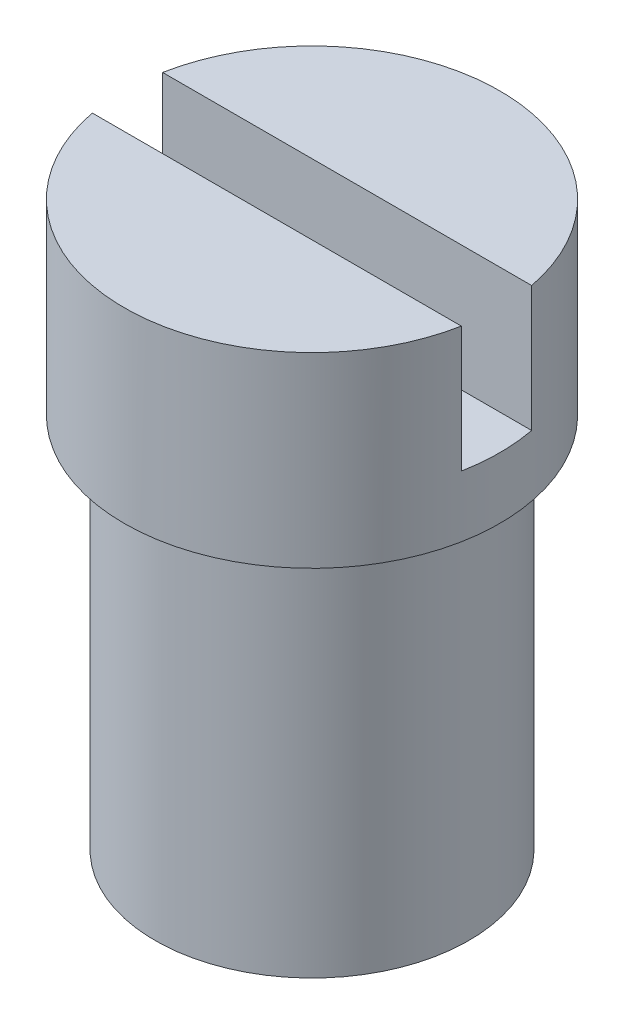
ISO-10303-21;
HEADER;
FILE_DESCRIPTION(('STEP AP214'),'2;1');
FILE_NAME('part.step','',(''),(''),'','','');
FILE_SCHEMA(('AUTOMOTIVE_DESIGN { 1 0 10303 214 1 1 1 1 }'));
ENDSEC;
DATA;
#1=APPLICATION_CONTEXT('core data for automotive mechanical design processes');
#2=APPLICATION_PROTOCOL_DEFINITION('international standard','automotive_design',2000,#1);
#3=PRODUCT_CONTEXT('',#1,'mechanical');
#4=PRODUCT('Part','Part','',(#3));
#5=PRODUCT_RELATED_PRODUCT_CATEGORY('part','',(#4));
#6=PRODUCT_DEFINITION_FORMATION('','',#4);
#7=PRODUCT_DEFINITION_CONTEXT('part definition',#1,'design');
#8=PRODUCT_DEFINITION('design','',#6,#7);
#9=PRODUCT_DEFINITION_SHAPE('','',#8);
#10=(LENGTH_UNIT() NAMED_UNIT(*) SI_UNIT(.MILLI.,.METRE.));
#11=(NAMED_UNIT(*) PLANE_ANGLE_UNIT() SI_UNIT($,.RADIAN.));
#12=(NAMED_UNIT(*) SI_UNIT($,.STERADIAN.) SOLID_ANGLE_UNIT());
#13=UNCERTAINTY_MEASURE_WITH_UNIT(LENGTH_MEASURE(1.E-05),#10,'distance_accuracy_value','');
#14=(GEOMETRIC_REPRESENTATION_CONTEXT(3) GLOBAL_UNCERTAINTY_ASSIGNED_CONTEXT((#13)) GLOBAL_UNIT_ASSIGNED_CONTEXT((#10,
#11,#12)) REPRESENTATION_CONTEXT('',''));
#15=CARTESIAN_POINT('',(0.,0.,0.));
#16=DIRECTION('',(0.,0.,1.));
#17=DIRECTION('',(1.,0.,0.));
#18=AXIS2_PLACEMENT_3D('',#15,#16,#17);
#19=CARTESIAN_POINT('',(0.,2.3622,0.));
#20=DIRECTION('',(0.,1.,0.));
#21=DIRECTION('',(0.,0.,1.));
#22=AXIS2_PLACEMENT_3D('',#19,#20,#21);
#23=PLANE('',#22);
#24=DIRECTION('',(1.,0.,0.));
#25=VECTOR('',#24,1.);
#26=CARTESIAN_POINT('',(0.,2.3622,0.4445));
#27=LINE('',#26,#25);
#28=CARTESIAN_POINT('',(-2.33293158065126,2.3622,0.4445));
#29=VERTEX_POINT('',#28);
#30=CARTESIAN_POINT('',(2.33293158065126,2.3622,0.4445));
#31=VERTEX_POINT('',#30);
#32=EDGE_CURVE('E96',#29,#31,#27,.T.);
#33=ORIENTED_EDGE('',*,*,#32,.F.);
#34=CARTESIAN_POINT('',(0.,2.3622,0.));
#35=DIRECTION('',(0.,1.,0.));
#36=DIRECTION('',(0.,0.,1.));
#37=AXIS2_PLACEMENT_3D('',#34,#35,#36);
#38=CIRCLE('',#37,2.3749);
#39=EDGE_CURVE('E109',#29,#31,#38,.T.);
#40=ORIENTED_EDGE('',*,*,#39,.T.);
#41=EDGE_LOOP('',(#33,#40));
#42=FACE_BOUND('',#41,.T.);
#43=ADVANCED_FACE('F46',(#42),#23,.T.);
#44=CARTESIAN_POINT('',(0.,2.3622,0.));
#45=DIRECTION('',(0.,-1.,0.));
#46=DIRECTION('',(0.,0.,-1.));
#47=AXIS2_PLACEMENT_3D('',#44,#45,#46);
#48=CYLINDRICAL_SURFACE('',#47,2.3749);
#49=CARTESIAN_POINT('',(0.,0.7747,0.));
#50=DIRECTION('',(0.,-1.,0.));
#51=DIRECTION('',(0.,0.,-1.));
#52=AXIS2_PLACEMENT_3D('',#49,#50,#51);
#53=CIRCLE('',#52,2.3749);
#54=CARTESIAN_POINT('',(2.33293158065126,0.7747,-0.4445));
#55=VERTEX_POINT('',#54);
#56=CARTESIAN_POINT('',(2.33293158065126,0.7747,0.4445));
#57=VERTEX_POINT('',#56);
#58=EDGE_CURVE('E12',#55,#57,#53,.T.);
#59=ORIENTED_EDGE('',*,*,#58,.T.);
#60=DIRECTION('',(0.,-1.,0.));
#61=VECTOR('',#60,1.);
#62=CARTESIAN_POINT('',(2.33293158065126,2.3622,0.4445));
#63=LINE('',#62,#61);
#64=EDGE_CURVE('E70',#57,#31,#63,.F.);
#65=ORIENTED_EDGE('',*,*,#64,.T.);
#66=ORIENTED_EDGE('',*,*,#39,.F.);
#67=DIRECTION('',(0.,-1.,0.));
#68=VECTOR('',#67,1.);
#69=CARTESIAN_POINT('',(-2.33293158065126,2.3622,0.4445));
#70=LINE('',#69,#68);
#71=CARTESIAN_POINT('',(-2.33293158065126,0.7747,0.4445));
#72=VERTEX_POINT('',#71);
#73=EDGE_CURVE('E126',#29,#72,#70,.T.);
#74=ORIENTED_EDGE('',*,*,#73,.T.);
#75=CARTESIAN_POINT('',(-2.33293158065126,0.7747,-0.4445));
#76=VERTEX_POINT('',#75);
#77=EDGE_CURVE('E50',#72,#76,#53,.T.);
#78=ORIENTED_EDGE('',*,*,#77,.T.);
#79=DIRECTION('',(0.,-1.,0.));
#80=VECTOR('',#79,1.);
#81=CARTESIAN_POINT('',(-2.33293158065126,2.3622,-0.4445));
#82=LINE('',#81,#80);
#83=CARTESIAN_POINT('',(-2.33293158065126,2.3622,-0.4445));
#84=VERTEX_POINT('',#83);
#85=EDGE_CURVE('E90',#76,#84,#82,.F.);
#86=ORIENTED_EDGE('',*,*,#85,.T.);
#87=CARTESIAN_POINT('',(2.33293158065126,2.3622,-0.4445));
#88=VERTEX_POINT('',#87);
#89=EDGE_CURVE('E102',#88,#84,#38,.T.);
#90=ORIENTED_EDGE('',*,*,#89,.F.);
#91=DIRECTION('',(0.,-1.,0.));
#92=VECTOR('',#91,1.);
#93=CARTESIAN_POINT('',(2.33293158065126,2.3622,-0.4445));
#94=LINE('',#93,#92);
#95=EDGE_CURVE('E62',#88,#55,#94,.T.);
#96=ORIENTED_EDGE('',*,*,#95,.T.);
#97=EDGE_LOOP('',(#59,#65,#66,#74,#78,#86,#90,#96));
#98=FACE_BOUND('',#97,.T.);
#99=CARTESIAN_POINT('',(0.,0.,0.));
#100=DIRECTION('',(0.,1.,0.));
#101=DIRECTION('',(0.,0.,1.));
#102=AXIS2_PLACEMENT_3D('',#99,#100,#101);
#103=CIRCLE('',#102,2.3749);
#104=CARTESIAN_POINT('',(0.,0.,2.3749));
#105=VERTEX_POINT('',#104);
#106=EDGE_CURVE('E116',#105,#105,#103,.T.);
#107=ORIENTED_EDGE('',*,*,#106,.T.);
#108=EDGE_LOOP('',(#107));
#109=FACE_BOUND('',#108,.T.);
#110=ADVANCED_FACE('F48',(#98,#109),#48,.T.);
#111=DIRECTION('',(-1.,0.,0.));
#112=VECTOR('',#111,1.);
#113=CARTESIAN_POINT('',(0.,2.3622,-0.4445));
#114=LINE('',#113,#112);
#115=EDGE_CURVE('E87',#88,#84,#114,.T.);
#116=ORIENTED_EDGE('',*,*,#115,.F.);
#117=ORIENTED_EDGE('',*,*,#89,.T.);
#118=EDGE_LOOP('',(#116,#117));
#119=FACE_BOUND('',#118,.T.);
#120=ADVANCED_FACE('F107',(#119),#23,.T.);
#121=CARTESIAN_POINT('',(0.,0.,0.));
#122=DIRECTION('',(0.,1.,0.));
#123=DIRECTION('',(0.,0.,1.));
#124=AXIS2_PLACEMENT_3D('',#121,#122,#123);
#125=PLANE('',#124);
#126=CARTESIAN_POINT('',(0.,0.,0.));
#127=DIRECTION('',(0.,-1.,0.));
#128=DIRECTION('',(0.,0.,-1.));
#129=AXIS2_PLACEMENT_3D('',#126,#127,#128);
#130=CIRCLE('',#129,1.984375);
#131=CARTESIAN_POINT('',(0.,0.,-1.984375));
#132=VERTEX_POINT('',#131);
#133=EDGE_CURVE('E97',#132,#132,#130,.T.);
#134=ORIENTED_EDGE('',*,*,#133,.F.);
#135=EDGE_LOOP('',(#134));
#136=FACE_BOUND('',#135,.T.);
#137=ORIENTED_EDGE('',*,*,#106,.F.);
#138=EDGE_LOOP('',(#137));
#139=FACE_BOUND('',#138,.T.);
#140=ADVANCED_FACE('F139',(#136,#139),#125,.F.);
#141=CARTESIAN_POINT('',(0.,-4.7625,0.));
#142=DIRECTION('',(0.,1.,0.));
#143=DIRECTION('',(0.,0.,1.));
#144=AXIS2_PLACEMENT_3D('',#141,#142,#143);
#145=CYLINDRICAL_SURFACE('',#144,1.984375);
#146=CARTESIAN_POINT('',(0.,-4.7625,0.));
#147=DIRECTION('',(0.,-1.,0.));
#148=DIRECTION('',(0.,0.,-1.));
#149=AXIS2_PLACEMENT_3D('',#146,#147,#148);
#150=CIRCLE('',#149,1.984375);
#151=CARTESIAN_POINT('',(0.,-4.7625,-1.984375));
#152=VERTEX_POINT('',#151);
#153=EDGE_CURVE('E121',#152,#152,#150,.T.);
#154=ORIENTED_EDGE('',*,*,#153,.F.);
#155=EDGE_LOOP('',(#154));
#156=FACE_BOUND('',#155,.T.);
#157=ORIENTED_EDGE('',*,*,#133,.T.);
#158=EDGE_LOOP('',(#157));
#159=FACE_BOUND('',#158,.T.);
#160=ADVANCED_FACE('F144',(#156,#159),#145,.T.);
#161=CARTESIAN_POINT('',(0.,-4.7625,0.));
#162=DIRECTION('',(0.,-1.,0.));
#163=DIRECTION('',(0.,0.,-1.));
#164=AXIS2_PLACEMENT_3D('',#161,#162,#163);
#165=PLANE('',#164);
#166=ORIENTED_EDGE('',*,*,#153,.T.);
#167=EDGE_LOOP('',(#166));
#168=FACE_BOUND('',#167,.T.);
#169=ADVANCED_FACE('F149',(#168),#165,.T.);
#170=CARTESIAN_POINT('',(0.,0.7747,0.));
#171=DIRECTION('',(0.,-1.,0.));
#172=DIRECTION('',(0.,0.,-1.));
#173=AXIS2_PLACEMENT_3D('',#170,#171,#172);
#174=PLANE('',#173);
#175=DIRECTION('',(-1.,0.,0.));
#176=VECTOR('',#175,1.);
#177=CARTESIAN_POINT('',(-2.3749,0.7747,-0.4445));
#178=LINE('',#177,#176);
#179=EDGE_CURVE('E169',#55,#76,#178,.T.);
#180=ORIENTED_EDGE('',*,*,#179,.T.);
#181=ORIENTED_EDGE('',*,*,#77,.F.);
#182=DIRECTION('',(1.,0.,0.));
#183=VECTOR('',#182,1.);
#184=CARTESIAN_POINT('',(-2.3749,0.7747,0.4445));
#185=LINE('',#184,#183);
#186=EDGE_CURVE('E105',#72,#57,#185,.T.);
#187=ORIENTED_EDGE('',*,*,#186,.T.);
#188=ORIENTED_EDGE('',*,*,#58,.F.);
#189=EDGE_LOOP('',(#180,#181,#187,#188));
#190=FACE_BOUND('',#189,.T.);
#191=ADVANCED_FACE('F157',(#190),#174,.F.);
#192=CARTESIAN_POINT('',(-2.3749,0.7747,0.4445));
#193=DIRECTION('',(0.,0.,1.));
#194=DIRECTION('',(1.,0.,0.));
#195=AXIS2_PLACEMENT_3D('',#192,#193,#194);
#196=PLANE('',#195);
#197=ORIENTED_EDGE('',*,*,#32,.T.);
#198=ORIENTED_EDGE('',*,*,#64,.F.);
#199=ORIENTED_EDGE('',*,*,#186,.F.);
#200=ORIENTED_EDGE('',*,*,#73,.F.);
#201=EDGE_LOOP('',(#197,#198,#199,#200));
#202=FACE_BOUND('',#201,.T.);
#203=ADVANCED_FACE('F125',(#202),#196,.F.);
#204=CARTESIAN_POINT('',(-2.3749,0.7747,-0.4445));
#205=DIRECTION('',(0.,0.,-1.));
#206=DIRECTION('',(-1.,0.,0.));
#207=AXIS2_PLACEMENT_3D('',#204,#205,#206);
#208=PLANE('',#207);
#209=ORIENTED_EDGE('',*,*,#115,.T.);
#210=ORIENTED_EDGE('',*,*,#85,.F.);
#211=ORIENTED_EDGE('',*,*,#179,.F.);
#212=ORIENTED_EDGE('',*,*,#95,.F.);
#213=EDGE_LOOP('',(#209,#210,#211,#212));
#214=FACE_BOUND('',#213,.T.);
#215=ADVANCED_FACE('F89',(#214),#208,.F.);
#216=CLOSED_SHELL('',(#43,#110,#120,#140,#160,#169,#191,#203,#215));
#217=MANIFOLD_SOLID_BREP('B2',#216);
#218=ADVANCED_BREP_SHAPE_REPRESENTATION('',(#18,#217),#14);
#219=SHAPE_DEFINITION_REPRESENTATION(#9,#218);
ENDSEC;
END-ISO-10303-21;
